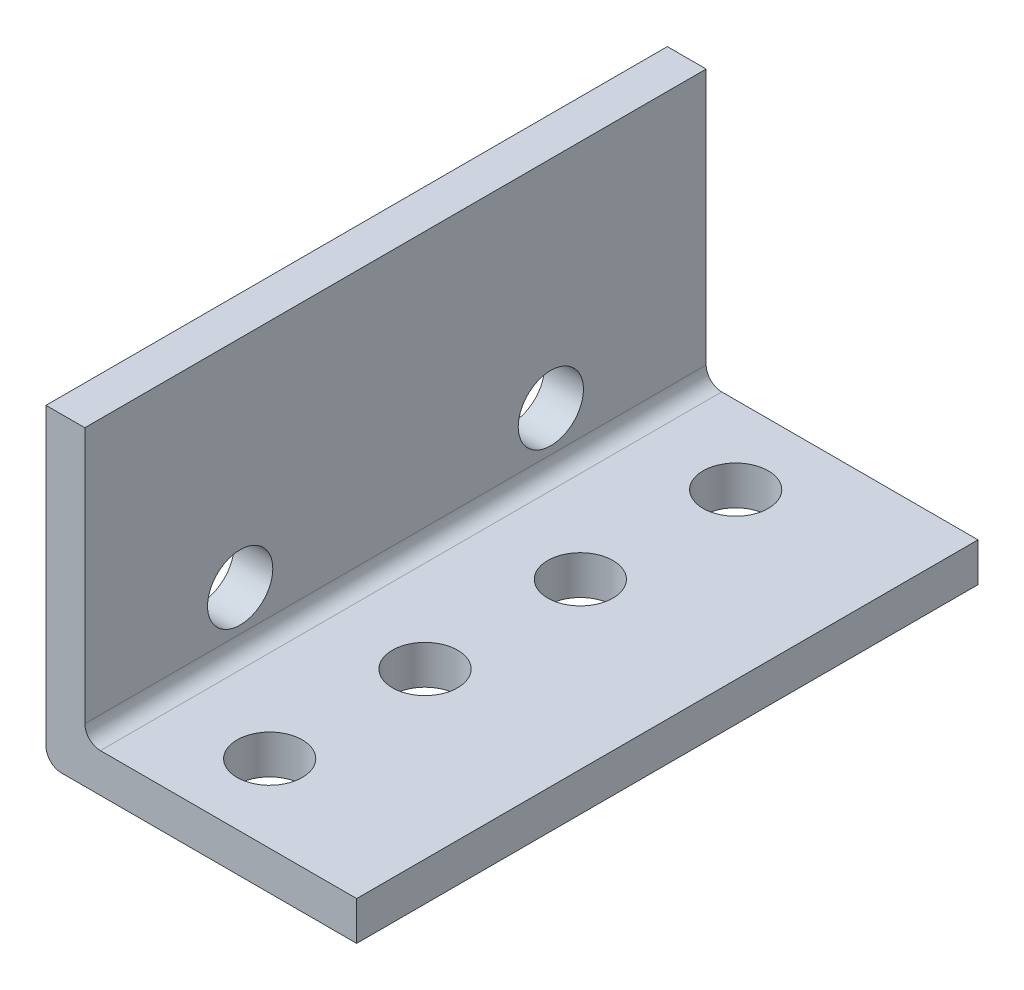
ISO-10303-21;
HEADER;
FILE_DESCRIPTION(('STEP AP214'),'2;1');
FILE_NAME('part.step','',(''),(''),'','','');
FILE_SCHEMA(('AUTOMOTIVE_DESIGN { 1 0 10303 214 1 1 1 1 }'));
ENDSEC;
DATA;
#1=APPLICATION_CONTEXT('core data for automotive mechanical design processes');
#2=APPLICATION_PROTOCOL_DEFINITION('international standard','automotive_design',2000,#1);
#3=PRODUCT_CONTEXT('',#1,'mechanical');
#4=PRODUCT('Part','Part','',(#3));
#5=PRODUCT_RELATED_PRODUCT_CATEGORY('part','',(#4));
#6=PRODUCT_DEFINITION_FORMATION('','',#4);
#7=PRODUCT_DEFINITION_CONTEXT('part definition',#1,'design');
#8=PRODUCT_DEFINITION('design','',#6,#7);
#9=PRODUCT_DEFINITION_SHAPE('','',#8);
#10=(LENGTH_UNIT() NAMED_UNIT(*) SI_UNIT(.MILLI.,.METRE.));
#11=(NAMED_UNIT(*) PLANE_ANGLE_UNIT() SI_UNIT($,.RADIAN.));
#12=(NAMED_UNIT(*) SI_UNIT($,.STERADIAN.) SOLID_ANGLE_UNIT());
#13=UNCERTAINTY_MEASURE_WITH_UNIT(LENGTH_MEASURE(1.E-05),#10,'distance_accuracy_value','');
#14=(GEOMETRIC_REPRESENTATION_CONTEXT(3) GLOBAL_UNCERTAINTY_ASSIGNED_CONTEXT((#13)) GLOBAL_UNIT_ASSIGNED_CONTEXT((#10,
#11,#12)) REPRESENTATION_CONTEXT('',''));
#15=CARTESIAN_POINT('',(0.,0.,0.));
#16=DIRECTION('',(0.,0.,1.));
#17=DIRECTION('',(1.,0.,0.));
#18=AXIS2_PLACEMENT_3D('',#15,#16,#17);
#19=CARTESIAN_POINT('',(0.,0.,50.8));
#20=DIRECTION('',(-1.,0.,0.));
#21=DIRECTION('',(0.,0.,1.));
#22=AXIS2_PLACEMENT_3D('',#19,#20,#21);
#23=PLANE('',#22);
#24=CARTESIAN_POINT('',(0.,-17.653,38.1));
#25=DIRECTION('',(-1.,0.,0.));
#26=DIRECTION('',(0.,0.,1.));
#27=AXIS2_PLACEMENT_3D('',#24,#25,#26);
#28=CIRCLE('',#27,2.667);
#29=CARTESIAN_POINT('',(0.,-17.653,40.767));
#30=VERTEX_POINT('',#29);
#31=EDGE_CURVE('E202',#30,#30,#28,.T.);
#32=ORIENTED_EDGE('',*,*,#31,.T.);
#33=EDGE_LOOP('',(#32));
#34=FACE_BOUND('',#33,.T.);
#35=CARTESIAN_POINT('',(0.,-17.653,12.7));
#36=DIRECTION('',(-1.,0.,0.));
#37=DIRECTION('',(0.,0.,1.));
#38=AXIS2_PLACEMENT_3D('',#35,#36,#37);
#39=CIRCLE('',#38,2.667);
#40=CARTESIAN_POINT('',(0.,-17.653,15.367));
#41=VERTEX_POINT('',#40);
#42=EDGE_CURVE('E210',#41,#41,#39,.T.);
#43=ORIENTED_EDGE('',*,*,#42,.T.);
#44=EDGE_LOOP('',(#43));
#45=FACE_BOUND('',#44,.T.);
#46=DIRECTION('',(0.,1.,0.));
#47=VECTOR('',#46,1.);
#48=CARTESIAN_POINT('',(0.,0.,50.8));
#49=LINE('',#48,#47);
#50=CARTESIAN_POINT('',(0.,-20.955,50.8));
#51=VERTEX_POINT('',#50);
#52=CARTESIAN_POINT('',(0.,0.,50.8));
#53=VERTEX_POINT('',#52);
#54=EDGE_CURVE('E104',#51,#53,#49,.T.);
#55=ORIENTED_EDGE('',*,*,#54,.F.);
#56=DIRECTION('',(0.,0.,-1.));
#57=VECTOR('',#56,1.);
#58=CARTESIAN_POINT('',(0.,-20.955,0.));
#59=LINE('',#58,#57);
#60=CARTESIAN_POINT('',(0.,-20.955,0.));
#61=VERTEX_POINT('',#60);
#62=EDGE_CURVE('E132',#51,#61,#59,.T.);
#63=ORIENTED_EDGE('',*,*,#62,.T.);
#64=DIRECTION('',(0.,1.,0.));
#65=VECTOR('',#64,1.);
#66=CARTESIAN_POINT('',(0.,0.,0.));
#67=LINE('',#66,#65);
#68=CARTESIAN_POINT('',(0.,0.,0.));
#69=VERTEX_POINT('',#68);
#70=EDGE_CURVE('E129',#61,#69,#67,.T.);
#71=ORIENTED_EDGE('',*,*,#70,.T.);
#72=DIRECTION('',(0.,0.,-1.));
#73=VECTOR('',#72,1.);
#74=CARTESIAN_POINT('',(0.,0.,50.8));
#75=LINE('',#74,#73);
#76=EDGE_CURVE('E122',#53,#69,#75,.T.);
#77=ORIENTED_EDGE('',*,*,#76,.F.);
#78=EDGE_LOOP('',(#55,#63,#71,#77));
#79=FACE_BOUND('',#78,.T.);
#80=ADVANCED_FACE('F39',(#34,#45,#79),#23,.F.);
#81=CARTESIAN_POINT('',(-3.175,0.,50.8));
#82=DIRECTION('',(0.,-1.,0.));
#83=DIRECTION('',(0.,0.,-1.));
#84=AXIS2_PLACEMENT_3D('',#81,#82,#83);
#85=PLANE('',#84);
#86=DIRECTION('',(-1.,0.,0.));
#87=VECTOR('',#86,1.);
#88=CARTESIAN_POINT('',(-3.175,0.,0.));
#89=LINE('',#88,#87);
#90=CARTESIAN_POINT('',(-3.175,0.,0.));
#91=VERTEX_POINT('',#90);
#92=EDGE_CURVE('E175',#69,#91,#89,.T.);
#93=ORIENTED_EDGE('',*,*,#92,.T.);
#94=DIRECTION('',(0.,0.,-1.));
#95=VECTOR('',#94,1.);
#96=CARTESIAN_POINT('',(-3.175,0.,50.8));
#97=LINE('',#96,#95);
#98=CARTESIAN_POINT('',(-3.175,0.,50.8));
#99=VERTEX_POINT('',#98);
#100=EDGE_CURVE('E124',#99,#91,#97,.T.);
#101=ORIENTED_EDGE('',*,*,#100,.F.);
#102=DIRECTION('',(-1.,0.,0.));
#103=VECTOR('',#102,1.);
#104=CARTESIAN_POINT('',(-3.175,0.,50.8));
#105=LINE('',#104,#103);
#106=EDGE_CURVE('E107',#53,#99,#105,.T.);
#107=ORIENTED_EDGE('',*,*,#106,.F.);
#108=ORIENTED_EDGE('',*,*,#76,.T.);
#109=EDGE_LOOP('',(#93,#101,#107,#108));
#110=FACE_BOUND('',#109,.T.);
#111=ADVANCED_FACE('F121',(#110),#85,.F.);
#112=CARTESIAN_POINT('',(-3.175,-25.4,50.8));
#113=DIRECTION('',(1.,0.,0.));
#114=DIRECTION('',(0.,0.,-1.));
#115=AXIS2_PLACEMENT_3D('',#112,#113,#114);
#116=PLANE('',#115);
#117=CARTESIAN_POINT('',(-3.175,-17.653,38.1));
#118=DIRECTION('',(1.,0.,0.));
#119=DIRECTION('',(0.,0.,-1.));
#120=AXIS2_PLACEMENT_3D('',#117,#118,#119);
#121=CIRCLE('',#120,2.667);
#122=CARTESIAN_POINT('',(-3.175,-17.653,35.433));
#123=VERTEX_POINT('',#122);
#124=EDGE_CURVE('E214',#123,#123,#121,.T.);
#125=ORIENTED_EDGE('',*,*,#124,.T.);
#126=EDGE_LOOP('',(#125));
#127=FACE_BOUND('',#126,.T.);
#128=CARTESIAN_POINT('',(-3.175,-17.653,12.7));
#129=DIRECTION('',(1.,0.,0.));
#130=DIRECTION('',(0.,0.,-1.));
#131=AXIS2_PLACEMENT_3D('',#128,#129,#130);
#132=CIRCLE('',#131,2.667);
#133=CARTESIAN_POINT('',(-3.175,-17.653,10.033));
#134=VERTEX_POINT('',#133);
#135=EDGE_CURVE('E215',#134,#134,#132,.T.);
#136=ORIENTED_EDGE('',*,*,#135,.T.);
#137=EDGE_LOOP('',(#136));
#138=FACE_BOUND('',#137,.T.);
#139=DIRECTION('',(0.,-1.,0.));
#140=VECTOR('',#139,1.);
#141=CARTESIAN_POINT('',(-3.175,-25.4,0.));
#142=LINE('',#141,#140);
#143=CARTESIAN_POINT('',(-3.175,-24.13,0.));
#144=VERTEX_POINT('',#143);
#145=EDGE_CURVE('E170',#91,#144,#142,.T.);
#146=ORIENTED_EDGE('',*,*,#145,.T.);
#147=DIRECTION('',(0.,0.,-1.));
#148=VECTOR('',#147,1.);
#149=CARTESIAN_POINT('',(-3.175,-24.13,50.8));
#150=LINE('',#149,#148);
#151=CARTESIAN_POINT('',(-3.175,-24.13,50.8));
#152=VERTEX_POINT('',#151);
#153=EDGE_CURVE('E48',#144,#152,#150,.F.);
#154=ORIENTED_EDGE('',*,*,#153,.T.);
#155=DIRECTION('',(0.,-1.,0.));
#156=VECTOR('',#155,1.);
#157=CARTESIAN_POINT('',(-3.175,-25.4,50.8));
#158=LINE('',#157,#156);
#159=EDGE_CURVE('E126',#99,#152,#158,.T.);
#160=ORIENTED_EDGE('',*,*,#159,.F.);
#161=ORIENTED_EDGE('',*,*,#100,.T.);
#162=EDGE_LOOP('',(#146,#154,#160,#161));
#163=FACE_BOUND('',#162,.T.);
#164=ADVANCED_FACE('F204',(#127,#138,#163),#116,.F.);
#165=CARTESIAN_POINT('',(22.225,-25.4,50.8));
#166=DIRECTION('',(0.,1.,0.));
#167=DIRECTION('',(0.,0.,1.));
#168=AXIS2_PLACEMENT_3D('',#165,#166,#167);
#169=PLANE('',#168);
#170=CARTESIAN_POINT('',(8.763,-25.4,44.45));
#171=DIRECTION('',(0.,1.,0.));
#172=DIRECTION('',(0.,0.,1.));
#173=AXIS2_PLACEMENT_3D('',#170,#171,#172);
#174=CIRCLE('',#173,2.667);
#175=CARTESIAN_POINT('',(8.763,-25.4,47.117));
#176=VERTEX_POINT('',#175);
#177=EDGE_CURVE('E219',#176,#176,#174,.F.);
#178=ORIENTED_EDGE('',*,*,#177,.F.);
#179=EDGE_LOOP('',(#178));
#180=FACE_BOUND('',#179,.T.);
#181=CARTESIAN_POINT('',(8.76299999999991,-25.4,19.05));
#182=DIRECTION('',(0.,1.,0.));
#183=DIRECTION('',(0.,0.,1.));
#184=AXIS2_PLACEMENT_3D('',#181,#182,#183);
#185=CIRCLE('',#184,2.667);
#186=CARTESIAN_POINT('',(8.76299999999991,-25.4,21.717));
#187=VERTEX_POINT('',#186);
#188=EDGE_CURVE('E240',#187,#187,#185,.F.);
#189=ORIENTED_EDGE('',*,*,#188,.F.);
#190=EDGE_LOOP('',(#189));
#191=FACE_BOUND('',#190,.T.);
#192=CARTESIAN_POINT('',(8.76299999999987,-25.4,6.35000000000001));
#193=DIRECTION('',(0.,1.,0.));
#194=DIRECTION('',(0.,0.,1.));
#195=AXIS2_PLACEMENT_3D('',#192,#193,#194);
#196=CIRCLE('',#195,2.667);
#197=CARTESIAN_POINT('',(8.76299999999987,-25.4,9.01700000000001));
#198=VERTEX_POINT('',#197);
#199=EDGE_CURVE('E232',#198,#198,#196,.F.);
#200=ORIENTED_EDGE('',*,*,#199,.F.);
#201=EDGE_LOOP('',(#200));
#202=FACE_BOUND('',#201,.T.);
#203=CARTESIAN_POINT('',(8.76299999999996,-25.4,31.75));
#204=DIRECTION('',(0.,1.,0.));
#205=DIRECTION('',(0.,0.,1.));
#206=AXIS2_PLACEMENT_3D('',#203,#204,#205);
#207=CIRCLE('',#206,2.667);
#208=CARTESIAN_POINT('',(8.76299999999996,-25.4,34.417));
#209=VERTEX_POINT('',#208);
#210=EDGE_CURVE('E223',#209,#209,#207,.F.);
#211=ORIENTED_EDGE('',*,*,#210,.F.);
#212=EDGE_LOOP('',(#211));
#213=FACE_BOUND('',#212,.T.);
#214=DIRECTION('',(1.,0.,0.));
#215=VECTOR('',#214,1.);
#216=CARTESIAN_POINT('',(22.225,-25.4,50.8));
#217=LINE('',#216,#215);
#218=CARTESIAN_POINT('',(-1.905,-25.4,50.8));
#219=VERTEX_POINT('',#218);
#220=CARTESIAN_POINT('',(22.225,-25.4,50.8));
#221=VERTEX_POINT('',#220);
#222=EDGE_CURVE('E162',#219,#221,#217,.T.);
#223=ORIENTED_EDGE('',*,*,#222,.F.);
#224=DIRECTION('',(0.,0.,-1.));
#225=VECTOR('',#224,1.);
#226=CARTESIAN_POINT('',(-1.905,-25.4,50.8));
#227=LINE('',#226,#225);
#228=CARTESIAN_POINT('',(-1.905,-25.4,0.));
#229=VERTEX_POINT('',#228);
#230=EDGE_CURVE('E149',#219,#229,#227,.T.);
#231=ORIENTED_EDGE('',*,*,#230,.T.);
#232=DIRECTION('',(1.,0.,0.));
#233=VECTOR('',#232,1.);
#234=CARTESIAN_POINT('',(22.225,-25.4,0.));
#235=LINE('',#234,#233);
#236=CARTESIAN_POINT('',(22.225,-25.4,0.));
#237=VERTEX_POINT('',#236);
#238=EDGE_CURVE('E160',#229,#237,#235,.T.);
#239=ORIENTED_EDGE('',*,*,#238,.T.);
#240=DIRECTION('',(0.,0.,-1.));
#241=VECTOR('',#240,1.);
#242=CARTESIAN_POINT('',(22.225,-25.4,50.8));
#243=LINE('',#242,#241);
#244=EDGE_CURVE('E138',#221,#237,#243,.T.);
#245=ORIENTED_EDGE('',*,*,#244,.F.);
#246=EDGE_LOOP('',(#223,#231,#239,#245));
#247=FACE_BOUND('',#246,.T.);
#248=ADVANCED_FACE('F158',(#180,#191,#202,#213,#247),#169,.F.);
#249=CARTESIAN_POINT('',(22.225,-22.225,50.8));
#250=DIRECTION('',(-1.,0.,0.));
#251=DIRECTION('',(0.,0.,1.));
#252=AXIS2_PLACEMENT_3D('',#249,#250,#251);
#253=PLANE('',#252);
#254=DIRECTION('',(0.,1.,0.));
#255=VECTOR('',#254,1.);
#256=CARTESIAN_POINT('',(22.225,-22.225,0.));
#257=LINE('',#256,#255);
#258=CARTESIAN_POINT('',(22.225,-22.225,0.));
#259=VERTEX_POINT('',#258);
#260=EDGE_CURVE('E168',#237,#259,#257,.T.);
#261=ORIENTED_EDGE('',*,*,#260,.T.);
#262=DIRECTION('',(0.,0.,-1.));
#263=VECTOR('',#262,1.);
#264=CARTESIAN_POINT('',(22.225,-22.225,50.8));
#265=LINE('',#264,#263);
#266=CARTESIAN_POINT('',(22.225,-22.225,50.8));
#267=VERTEX_POINT('',#266);
#268=EDGE_CURVE('E182',#267,#259,#265,.T.);
#269=ORIENTED_EDGE('',*,*,#268,.F.);
#270=DIRECTION('',(0.,1.,0.));
#271=VECTOR('',#270,1.);
#272=CARTESIAN_POINT('',(22.225,-22.225,50.8));
#273=LINE('',#272,#271);
#274=EDGE_CURVE('E191',#221,#267,#273,.T.);
#275=ORIENTED_EDGE('',*,*,#274,.F.);
#276=ORIENTED_EDGE('',*,*,#244,.T.);
#277=EDGE_LOOP('',(#261,#269,#275,#276));
#278=FACE_BOUND('',#277,.T.);
#279=ADVANCED_FACE('F189',(#278),#253,.F.);
#280=CARTESIAN_POINT('',(0.,-22.225,50.8));
#281=DIRECTION('',(0.,-1.,0.));
#282=DIRECTION('',(0.,0.,-1.));
#283=AXIS2_PLACEMENT_3D('',#280,#281,#282);
#284=PLANE('',#283);
#285=CARTESIAN_POINT('',(8.763,-22.225,44.45));
#286=DIRECTION('',(0.,1.,0.));
#287=DIRECTION('',(0.,0.,1.));
#288=AXIS2_PLACEMENT_3D('',#285,#286,#287);
#289=CIRCLE('',#288,2.667);
#290=CARTESIAN_POINT('',(8.763,-22.225,47.117));
#291=VERTEX_POINT('',#290);
#292=EDGE_CURVE('E244',#291,#291,#289,.T.);
#293=ORIENTED_EDGE('',*,*,#292,.F.);
#294=EDGE_LOOP('',(#293));
#295=FACE_BOUND('',#294,.T.);
#296=CARTESIAN_POINT('',(8.76299999999991,-22.225,19.05));
#297=DIRECTION('',(0.,1.,0.));
#298=DIRECTION('',(0.,0.,1.));
#299=AXIS2_PLACEMENT_3D('',#296,#297,#298);
#300=CIRCLE('',#299,2.667);
#301=CARTESIAN_POINT('',(8.76299999999991,-22.225,21.717));
#302=VERTEX_POINT('',#301);
#303=EDGE_CURVE('E236',#302,#302,#300,.T.);
#304=ORIENTED_EDGE('',*,*,#303,.F.);
#305=EDGE_LOOP('',(#304));
#306=FACE_BOUND('',#305,.T.);
#307=CARTESIAN_POINT('',(8.76299999999987,-22.225,6.35000000000001));
#308=DIRECTION('',(0.,1.,0.));
#309=DIRECTION('',(0.,0.,1.));
#310=AXIS2_PLACEMENT_3D('',#307,#308,#309);
#311=CIRCLE('',#310,2.667);
#312=CARTESIAN_POINT('',(8.76299999999987,-22.225,9.01700000000001));
#313=VERTEX_POINT('',#312);
#314=EDGE_CURVE('E227',#313,#313,#311,.T.);
#315=ORIENTED_EDGE('',*,*,#314,.F.);
#316=EDGE_LOOP('',(#315));
#317=FACE_BOUND('',#316,.T.);
#318=CARTESIAN_POINT('',(8.76299999999996,-22.225,31.75));
#319=DIRECTION('',(0.,1.,0.));
#320=DIRECTION('',(0.,0.,1.));
#321=AXIS2_PLACEMENT_3D('',#318,#319,#320);
#322=CIRCLE('',#321,2.667);
#323=CARTESIAN_POINT('',(8.76299999999996,-22.225,34.417));
#324=VERTEX_POINT('',#323);
#325=EDGE_CURVE('E228',#324,#324,#322,.T.);
#326=ORIENTED_EDGE('',*,*,#325,.F.);
#327=EDGE_LOOP('',(#326));
#328=FACE_BOUND('',#327,.T.);
#329=DIRECTION('',(-1.,0.,0.));
#330=VECTOR('',#329,1.);
#331=CARTESIAN_POINT('',(0.,-22.225,0.));
#332=LINE('',#331,#330);
#333=CARTESIAN_POINT('',(1.27,-22.225,0.));
#334=VERTEX_POINT('',#333);
#335=EDGE_CURVE('E117',#259,#334,#332,.T.);
#336=ORIENTED_EDGE('',*,*,#335,.T.);
#337=DIRECTION('',(0.,0.,-1.));
#338=VECTOR('',#337,1.);
#339=CARTESIAN_POINT('',(1.27,-22.225,50.8));
#340=LINE('',#339,#338);
#341=CARTESIAN_POINT('',(1.27,-22.225,50.8));
#342=VERTEX_POINT('',#341);
#343=EDGE_CURVE('E136',#334,#342,#340,.F.);
#344=ORIENTED_EDGE('',*,*,#343,.T.);
#345=DIRECTION('',(-1.,0.,0.));
#346=VECTOR('',#345,1.);
#347=CARTESIAN_POINT('',(0.,-22.225,50.8));
#348=LINE('',#347,#346);
#349=EDGE_CURVE('E185',#267,#342,#348,.T.);
#350=ORIENTED_EDGE('',*,*,#349,.F.);
#351=ORIENTED_EDGE('',*,*,#268,.T.);
#352=EDGE_LOOP('',(#336,#344,#350,#351));
#353=FACE_BOUND('',#352,.T.);
#354=ADVANCED_FACE('F257',(#295,#306,#317,#328,#353),#284,.F.);
#355=CARTESIAN_POINT('',(0.,0.,50.8));
#356=DIRECTION('',(0.,0.,1.));
#357=DIRECTION('',(1.,0.,0.));
#358=AXIS2_PLACEMENT_3D('',#355,#356,#357);
#359=PLANE('',#358);
#360=ORIENTED_EDGE('',*,*,#159,.T.);
#361=CARTESIAN_POINT('',(-1.905,-24.13,50.8));
#362=DIRECTION('',(0.,0.,1.));
#363=DIRECTION('',(1.,0.,0.));
#364=AXIS2_PLACEMENT_3D('',#361,#362,#363);
#365=CIRCLE('',#364,1.27);
#366=EDGE_CURVE('E11',#152,#219,#365,.T.);
#367=ORIENTED_EDGE('',*,*,#366,.T.);
#368=ORIENTED_EDGE('',*,*,#222,.T.);
#369=ORIENTED_EDGE('',*,*,#274,.T.);
#370=ORIENTED_EDGE('',*,*,#349,.T.);
#371=CARTESIAN_POINT('',(1.27,-20.955,50.8));
#372=DIRECTION('',(0.,0.,1.));
#373=DIRECTION('',(1.,0.,0.));
#374=AXIS2_PLACEMENT_3D('',#371,#372,#373);
#375=CIRCLE('',#374,1.27);
#376=EDGE_CURVE('E111',#342,#51,#375,.F.);
#377=ORIENTED_EDGE('',*,*,#376,.T.);
#378=ORIENTED_EDGE('',*,*,#54,.T.);
#379=ORIENTED_EDGE('',*,*,#106,.T.);
#380=EDGE_LOOP('',(#360,#367,#368,#369,#370,#377,#378,#379));
#381=FACE_BOUND('',#380,.T.);
#382=ADVANCED_FACE('F106',(#381),#359,.T.);
#383=CARTESIAN_POINT('',(0.,0.,0.));
#384=DIRECTION('',(0.,0.,1.));
#385=DIRECTION('',(1.,0.,0.));
#386=AXIS2_PLACEMENT_3D('',#383,#384,#385);
#387=PLANE('',#386);
#388=ORIENTED_EDGE('',*,*,#238,.F.);
#389=CARTESIAN_POINT('',(-1.905,-24.13,0.));
#390=DIRECTION('',(0.,0.,1.));
#391=DIRECTION('',(1.,0.,0.));
#392=AXIS2_PLACEMENT_3D('',#389,#390,#391);
#393=CIRCLE('',#392,1.27);
#394=EDGE_CURVE('E62',#229,#144,#393,.F.);
#395=ORIENTED_EDGE('',*,*,#394,.T.);
#396=ORIENTED_EDGE('',*,*,#145,.F.);
#397=ORIENTED_EDGE('',*,*,#92,.F.);
#398=ORIENTED_EDGE('',*,*,#70,.F.);
#399=CARTESIAN_POINT('',(1.27,-20.955,0.));
#400=DIRECTION('',(0.,0.,1.));
#401=DIRECTION('',(1.,0.,0.));
#402=AXIS2_PLACEMENT_3D('',#399,#400,#401);
#403=CIRCLE('',#402,1.27);
#404=EDGE_CURVE('E144',#61,#334,#403,.T.);
#405=ORIENTED_EDGE('',*,*,#404,.T.);
#406=ORIENTED_EDGE('',*,*,#335,.F.);
#407=ORIENTED_EDGE('',*,*,#260,.F.);
#408=EDGE_LOOP('',(#388,#395,#396,#397,#398,#405,#406,#407));
#409=FACE_BOUND('',#408,.T.);
#410=ADVANCED_FACE('F166',(#409),#387,.F.);
#411=CARTESIAN_POINT('',(-3.175,-17.653,12.7));
#412=DIRECTION('',(1.,0.,0.));
#413=DIRECTION('',(0.,0.,-1.));
#414=AXIS2_PLACEMENT_3D('',#411,#412,#413);
#415=CYLINDRICAL_SURFACE('',#414,2.667);
#416=ORIENTED_EDGE('',*,*,#135,.F.);
#417=EDGE_LOOP('',(#416));
#418=FACE_BOUND('',#417,.T.);
#419=ORIENTED_EDGE('',*,*,#42,.F.);
#420=EDGE_LOOP('',(#419));
#421=FACE_BOUND('',#420,.T.);
#422=ADVANCED_FACE('F297',(#418,#421),#415,.F.);
#423=CARTESIAN_POINT('',(-3.175,-17.653,38.1));
#424=DIRECTION('',(1.,0.,0.));
#425=DIRECTION('',(0.,0.,-1.));
#426=AXIS2_PLACEMENT_3D('',#423,#424,#425);
#427=CYLINDRICAL_SURFACE('',#426,2.667);
#428=ORIENTED_EDGE('',*,*,#124,.F.);
#429=EDGE_LOOP('',(#428));
#430=FACE_BOUND('',#429,.T.);
#431=ORIENTED_EDGE('',*,*,#31,.F.);
#432=EDGE_LOOP('',(#431));
#433=FACE_BOUND('',#432,.T.);
#434=ADVANCED_FACE('F302',(#430,#433),#427,.F.);
#435=CARTESIAN_POINT('',(8.76299999999996,-32.9434151416981,31.75));
#436=DIRECTION('',(0.,1.,0.));
#437=DIRECTION('',(0.,0.,1.));
#438=AXIS2_PLACEMENT_3D('',#435,#436,#437);
#439=CYLINDRICAL_SURFACE('',#438,2.667);
#440=ORIENTED_EDGE('',*,*,#210,.T.);
#441=EDGE_LOOP('',(#440));
#442=FACE_BOUND('',#441,.T.);
#443=ORIENTED_EDGE('',*,*,#325,.T.);
#444=EDGE_LOOP('',(#443));
#445=FACE_BOUND('',#444,.T.);
#446=ADVANCED_FACE('F306',(#442,#445),#439,.F.);
#447=CARTESIAN_POINT('',(8.76299999999987,-32.9434151416981,6.35000000000001));
#448=DIRECTION('',(0.,1.,0.));
#449=DIRECTION('',(0.,0.,1.));
#450=AXIS2_PLACEMENT_3D('',#447,#448,#449);
#451=CYLINDRICAL_SURFACE('',#450,2.667);
#452=ORIENTED_EDGE('',*,*,#199,.T.);
#453=EDGE_LOOP('',(#452));
#454=FACE_BOUND('',#453,.T.);
#455=ORIENTED_EDGE('',*,*,#314,.T.);
#456=EDGE_LOOP('',(#455));
#457=FACE_BOUND('',#456,.T.);
#458=ADVANCED_FACE('F310',(#454,#457),#451,.F.);
#459=CARTESIAN_POINT('',(8.76299999999991,-32.9434151416981,19.05));
#460=DIRECTION('',(0.,1.,0.));
#461=DIRECTION('',(0.,0.,1.));
#462=AXIS2_PLACEMENT_3D('',#459,#460,#461);
#463=CYLINDRICAL_SURFACE('',#462,2.667);
#464=ORIENTED_EDGE('',*,*,#188,.T.);
#465=EDGE_LOOP('',(#464));
#466=FACE_BOUND('',#465,.T.);
#467=ORIENTED_EDGE('',*,*,#303,.T.);
#468=EDGE_LOOP('',(#467));
#469=FACE_BOUND('',#468,.T.);
#470=ADVANCED_FACE('F275',(#466,#469),#463,.F.);
#471=CARTESIAN_POINT('',(8.763,-32.9434151416981,44.45));
#472=DIRECTION('',(0.,1.,0.));
#473=DIRECTION('',(0.,0.,1.));
#474=AXIS2_PLACEMENT_3D('',#471,#472,#473);
#475=CYLINDRICAL_SURFACE('',#474,2.667);
#476=ORIENTED_EDGE('',*,*,#177,.T.);
#477=EDGE_LOOP('',(#476));
#478=FACE_BOUND('',#477,.T.);
#479=ORIENTED_EDGE('',*,*,#292,.T.);
#480=EDGE_LOOP('',(#479));
#481=FACE_BOUND('',#480,.T.);
#482=ADVANCED_FACE('F255',(#478,#481),#475,.F.);
#483=CARTESIAN_POINT('',(1.27,-20.955,50.8));
#484=DIRECTION('',(0.,0.,1.));
#485=DIRECTION('',(1.,0.,0.));
#486=AXIS2_PLACEMENT_3D('',#483,#484,#485);
#487=CYLINDRICAL_SURFACE('',#486,1.27);
#488=ORIENTED_EDGE('',*,*,#376,.F.);
#489=ORIENTED_EDGE('',*,*,#343,.F.);
#490=ORIENTED_EDGE('',*,*,#404,.F.);
#491=ORIENTED_EDGE('',*,*,#62,.F.);
#492=EDGE_LOOP('',(#488,#489,#490,#491));
#493=FACE_BOUND('',#492,.T.);
#494=ADVANCED_FACE('F269',(#493),#487,.F.);
#495=CARTESIAN_POINT('',(-1.905,-24.13,50.8));
#496=DIRECTION('',(0.,0.,-1.));
#497=DIRECTION('',(-1.,0.,0.));
#498=AXIS2_PLACEMENT_3D('',#495,#496,#497);
#499=CYLINDRICAL_SURFACE('',#498,1.27);
#500=ORIENTED_EDGE('',*,*,#366,.F.);
#501=ORIENTED_EDGE('',*,*,#153,.F.);
#502=ORIENTED_EDGE('',*,*,#394,.F.);
#503=ORIENTED_EDGE('',*,*,#230,.F.);
#504=EDGE_LOOP('',(#500,#501,#502,#503));
#505=FACE_BOUND('',#504,.T.);
#506=ADVANCED_FACE('F41',(#505),#499,.T.);
#507=CLOSED_SHELL('',(#80,#111,#164,#248,#279,#354,#382,#410,#422,#434,#446,#458,#470,#482,#494,#506));
#508=MANIFOLD_SOLID_BREP('B2',#507);
#509=ADVANCED_BREP_SHAPE_REPRESENTATION('',(#18,#508),#14);
#510=SHAPE_DEFINITION_REPRESENTATION(#9,#509);
ENDSEC;
END-ISO-10303-21;
